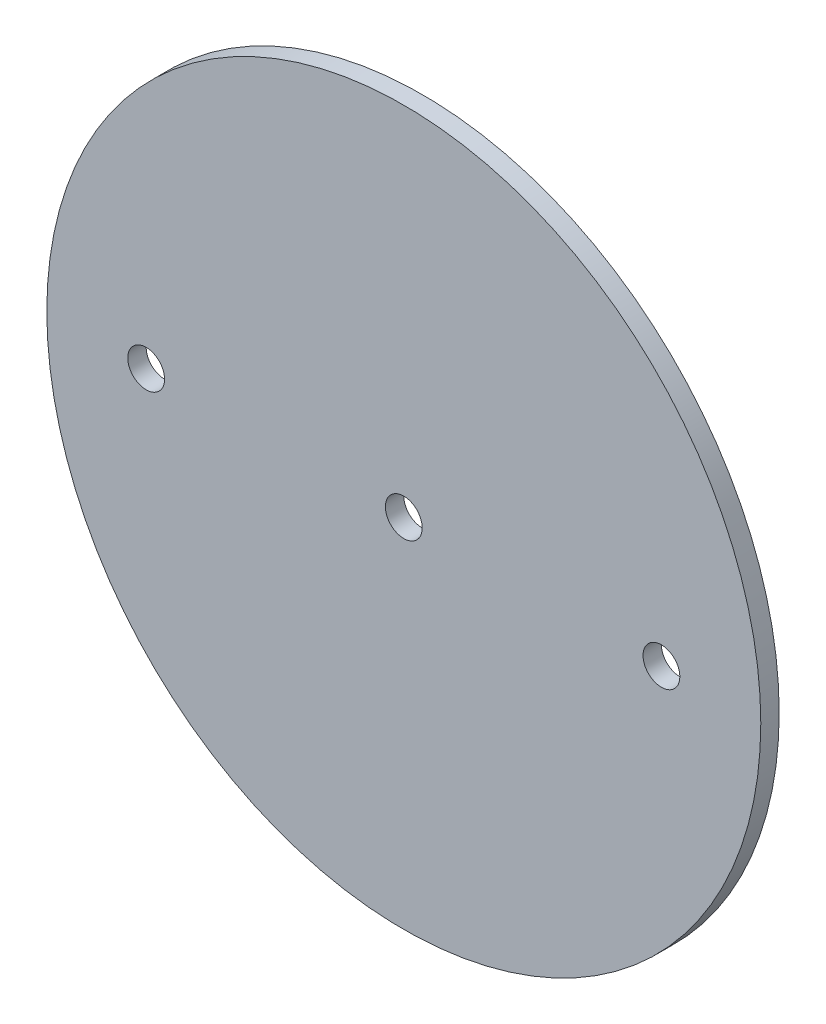
ISO-10303-21;
HEADER;
FILE_DESCRIPTION(('STEP AP214'),'2;1');
FILE_NAME('part.step','',(''),(''),'','','');
FILE_SCHEMA(('AUTOMOTIVE_DESIGN { 1 0 10303 214 1 1 1 1 }'));
ENDSEC;
DATA;
#1=APPLICATION_CONTEXT('core data for automotive mechanical design processes');
#2=APPLICATION_PROTOCOL_DEFINITION('international standard','automotive_design',2000,#1);
#3=PRODUCT_CONTEXT('',#1,'mechanical');
#4=PRODUCT('Part','Part','',(#3));
#5=PRODUCT_RELATED_PRODUCT_CATEGORY('part','',(#4));
#6=PRODUCT_DEFINITION_FORMATION('','',#4);
#7=PRODUCT_DEFINITION_CONTEXT('part definition',#1,'design');
#8=PRODUCT_DEFINITION('design','',#6,#7);
#9=PRODUCT_DEFINITION_SHAPE('','',#8);
#10=(LENGTH_UNIT() NAMED_UNIT(*) SI_UNIT(.MILLI.,.METRE.));
#11=(NAMED_UNIT(*) PLANE_ANGLE_UNIT() SI_UNIT($,.RADIAN.));
#12=(NAMED_UNIT(*) SI_UNIT($,.STERADIAN.) SOLID_ANGLE_UNIT());
#13=UNCERTAINTY_MEASURE_WITH_UNIT(LENGTH_MEASURE(1.E-05),#10,'distance_accuracy_value','');
#14=(GEOMETRIC_REPRESENTATION_CONTEXT(3) GLOBAL_UNCERTAINTY_ASSIGNED_CONTEXT((#13)) GLOBAL_UNIT_ASSIGNED_CONTEXT((#10,
#11,#12)) REPRESENTATION_CONTEXT('',''));
#15=CARTESIAN_POINT('',(0.,0.,0.));
#16=DIRECTION('',(0.,0.,1.));
#17=DIRECTION('',(1.,0.,0.));
#18=AXIS2_PLACEMENT_3D('',#15,#16,#17);
#19=CARTESIAN_POINT('',(0.,0.,1.5875));
#20=DIRECTION('',(0.,0.,-1.));
#21=DIRECTION('',(-1.,0.,0.));
#22=AXIS2_PLACEMENT_3D('',#19,#20,#21);
#23=CYLINDRICAL_SURFACE('',#22,61.595);
#24=CARTESIAN_POINT('',(0.,0.,1.5875));
#25=DIRECTION('',(0.,0.,1.));
#26=DIRECTION('',(1.,0.,0.));
#27=AXIS2_PLACEMENT_3D('',#24,#25,#26);
#28=CIRCLE('',#27,61.595);
#29=CARTESIAN_POINT('',(61.595,0.,1.5875));
#30=VERTEX_POINT('',#29);
#31=EDGE_CURVE('E10',#30,#30,#28,.T.);
#32=ORIENTED_EDGE('',*,*,#31,.F.);
#33=EDGE_LOOP('',(#32));
#34=FACE_BOUND('',#33,.T.);
#35=CARTESIAN_POINT('',(0.,0.,-1.5875));
#36=DIRECTION('',(0.,0.,1.));
#37=DIRECTION('',(1.,0.,0.));
#38=AXIS2_PLACEMENT_3D('',#35,#36,#37);
#39=CIRCLE('',#38,61.595);
#40=CARTESIAN_POINT('',(61.595,0.,-1.5875));
#41=VERTEX_POINT('',#40);
#42=EDGE_CURVE('E46',#41,#41,#39,.T.);
#43=ORIENTED_EDGE('',*,*,#42,.T.);
#44=EDGE_LOOP('',(#43));
#45=FACE_BOUND('',#44,.T.);
#46=ADVANCED_FACE('F43',(#34,#45),#23,.T.);
#47=CARTESIAN_POINT('',(0.,0.,1.5875));
#48=DIRECTION('',(0.,0.,1.));
#49=DIRECTION('',(1.,0.,0.));
#50=AXIS2_PLACEMENT_3D('',#47,#48,#49);
#51=PLANE('',#50);
#52=CARTESIAN_POINT('',(0.,0.,1.5875));
#53=DIRECTION('',(0.,0.,1.));
#54=DIRECTION('',(1.,0.,0.));
#55=AXIS2_PLACEMENT_3D('',#52,#53,#54);
#56=CIRCLE('',#55,3.17499999999999);
#57=CARTESIAN_POINT('',(3.17499999999999,0.,1.5875));
#58=VERTEX_POINT('',#57);
#59=EDGE_CURVE('E69',#58,#58,#56,.T.);
#60=ORIENTED_EDGE('',*,*,#59,.F.);
#61=EDGE_LOOP('',(#60));
#62=FACE_BOUND('',#61,.T.);
#63=CARTESIAN_POINT('',(44.45,0.,1.5875));
#64=DIRECTION('',(0.,0.,1.));
#65=DIRECTION('',(1.,0.,0.));
#66=AXIS2_PLACEMENT_3D('',#63,#64,#65);
#67=CIRCLE('',#66,3.17499999999998);
#68=CARTESIAN_POINT('',(47.625,0.,1.5875));
#69=VERTEX_POINT('',#68);
#70=EDGE_CURVE('E63',#69,#69,#67,.T.);
#71=ORIENTED_EDGE('',*,*,#70,.F.);
#72=EDGE_LOOP('',(#71));
#73=FACE_BOUND('',#72,.T.);
#74=CARTESIAN_POINT('',(-44.45,0.,1.5875));
#75=DIRECTION('',(0.,0.,1.));
#76=DIRECTION('',(1.,0.,0.));
#77=AXIS2_PLACEMENT_3D('',#74,#75,#76);
#78=CIRCLE('',#77,3.17499999999999);
#79=CARTESIAN_POINT('',(-41.275,0.,1.5875));
#80=VERTEX_POINT('',#79);
#81=EDGE_CURVE('E57',#80,#80,#78,.T.);
#82=ORIENTED_EDGE('',*,*,#81,.F.);
#83=EDGE_LOOP('',(#82));
#84=FACE_BOUND('',#83,.T.);
#85=ORIENTED_EDGE('',*,*,#31,.T.);
#86=EDGE_LOOP('',(#85));
#87=FACE_BOUND('',#86,.T.);
#88=ADVANCED_FACE('F75',(#62,#73,#84,#87),#51,.T.);
#89=CARTESIAN_POINT('',(0.,0.,-1.5875));
#90=DIRECTION('',(0.,0.,1.));
#91=DIRECTION('',(1.,0.,0.));
#92=AXIS2_PLACEMENT_3D('',#89,#90,#91);
#93=PLANE('',#92);
#94=CARTESIAN_POINT('',(0.,0.,-1.5875));
#95=DIRECTION('',(0.,0.,1.));
#96=DIRECTION('',(1.,0.,0.));
#97=AXIS2_PLACEMENT_3D('',#94,#95,#96);
#98=CIRCLE('',#97,3.17499999999999);
#99=CARTESIAN_POINT('',(3.17499999999999,0.,-1.5875));
#100=VERTEX_POINT('',#99);
#101=EDGE_CURVE('E66',#100,#100,#98,.T.);
#102=ORIENTED_EDGE('',*,*,#101,.T.);
#103=EDGE_LOOP('',(#102));
#104=FACE_BOUND('',#103,.T.);
#105=CARTESIAN_POINT('',(44.45,0.,-1.5875));
#106=DIRECTION('',(0.,0.,1.));
#107=DIRECTION('',(1.,0.,0.));
#108=AXIS2_PLACEMENT_3D('',#105,#106,#107);
#109=CIRCLE('',#108,3.17499999999999);
#110=CARTESIAN_POINT('',(47.625,0.,-1.5875));
#111=VERTEX_POINT('',#110);
#112=EDGE_CURVE('E60',#111,#111,#109,.T.);
#113=ORIENTED_EDGE('',*,*,#112,.T.);
#114=EDGE_LOOP('',(#113));
#115=FACE_BOUND('',#114,.T.);
#116=CARTESIAN_POINT('',(-44.45,0.,-1.5875));
#117=DIRECTION('',(0.,0.,1.));
#118=DIRECTION('',(1.,0.,0.));
#119=AXIS2_PLACEMENT_3D('',#116,#117,#118);
#120=CIRCLE('',#119,3.17499999999999);
#121=CARTESIAN_POINT('',(-41.275,0.,-1.5875));
#122=VERTEX_POINT('',#121);
#123=EDGE_CURVE('E53',#122,#122,#120,.T.);
#124=ORIENTED_EDGE('',*,*,#123,.T.);
#125=EDGE_LOOP('',(#124));
#126=FACE_BOUND('',#125,.T.);
#127=ORIENTED_EDGE('',*,*,#42,.F.);
#128=EDGE_LOOP('',(#127));
#129=FACE_BOUND('',#128,.T.);
#130=ADVANCED_FACE('F78',(#104,#115,#126,#129),#93,.F.);
#131=CARTESIAN_POINT('',(-44.45,0.,1.5875));
#132=DIRECTION('',(0.,0.,1.));
#133=DIRECTION('',(1.,0.,0.));
#134=AXIS2_PLACEMENT_3D('',#131,#132,#133);
#135=CYLINDRICAL_SURFACE('',#134,3.17499999999999);
#136=ORIENTED_EDGE('',*,*,#123,.F.);
#137=EDGE_LOOP('',(#136));
#138=FACE_BOUND('',#137,.T.);
#139=ORIENTED_EDGE('',*,*,#81,.T.);
#140=EDGE_LOOP('',(#139));
#141=FACE_BOUND('',#140,.T.);
#142=ADVANCED_FACE('F84',(#138,#141),#135,.F.);
#143=CARTESIAN_POINT('',(44.45,0.,1.5875));
#144=DIRECTION('',(0.,0.,1.));
#145=DIRECTION('',(1.,0.,0.));
#146=AXIS2_PLACEMENT_3D('',#143,#144,#145);
#147=CYLINDRICAL_SURFACE('',#146,3.17499999999999);
#148=ORIENTED_EDGE('',*,*,#112,.F.);
#149=EDGE_LOOP('',(#148));
#150=FACE_BOUND('',#149,.T.);
#151=ORIENTED_EDGE('',*,*,#70,.T.);
#152=EDGE_LOOP('',(#151));
#153=FACE_BOUND('',#152,.T.);
#154=ADVANCED_FACE('F86',(#150,#153),#147,.F.);
#155=CARTESIAN_POINT('',(0.,0.,1.5875));
#156=DIRECTION('',(0.,0.,1.));
#157=DIRECTION('',(1.,0.,0.));
#158=AXIS2_PLACEMENT_3D('',#155,#156,#157);
#159=CYLINDRICAL_SURFACE('',#158,3.17499999999999);
#160=ORIENTED_EDGE('',*,*,#101,.F.);
#161=EDGE_LOOP('',(#160));
#162=FACE_BOUND('',#161,.T.);
#163=ORIENTED_EDGE('',*,*,#59,.T.);
#164=EDGE_LOOP('',(#163));
#165=FACE_BOUND('',#164,.T.);
#166=ADVANCED_FACE('F73',(#162,#165),#159,.F.);
#167=CLOSED_SHELL('',(#46,#88,#130,#142,#154,#166));
#168=MANIFOLD_SOLID_BREP('B2',#167);
#169=ADVANCED_BREP_SHAPE_REPRESENTATION('',(#18,#168),#14);
#170=SHAPE_DEFINITION_REPRESENTATION(#9,#169);
ENDSEC;
END-ISO-10303-21;
